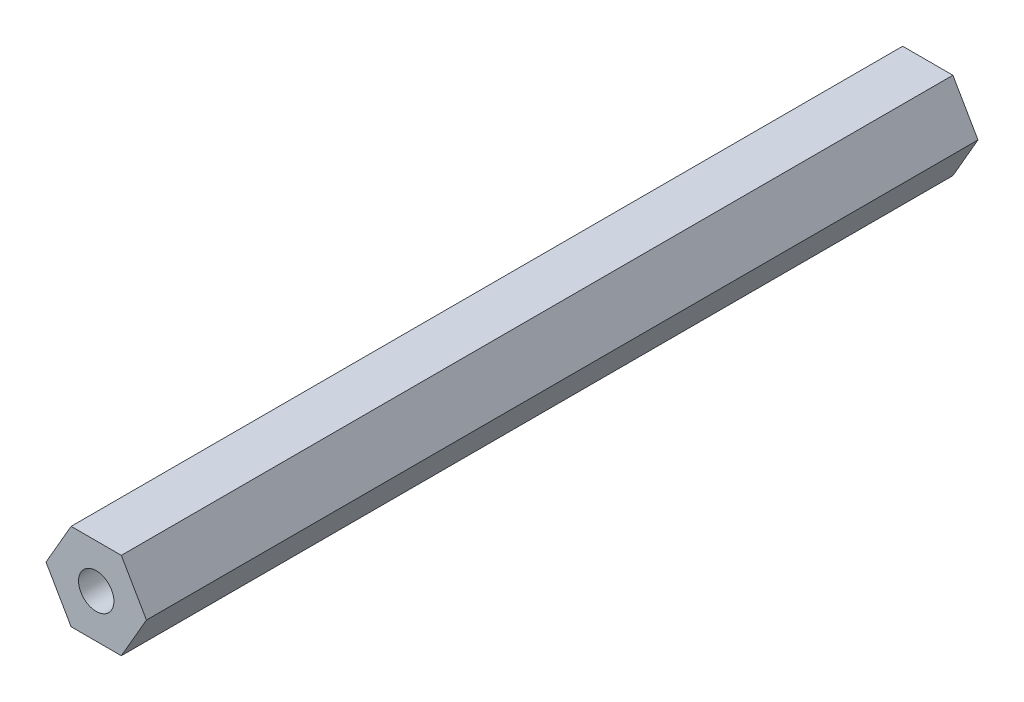
ISO-10303-21;
HEADER;
FILE_DESCRIPTION(('STEP AP214'),'2;1');
FILE_NAME('part.step','',(''),(''),'','','');
FILE_SCHEMA(('AUTOMOTIVE_DESIGN { 1 0 10303 214 1 1 1 1 }'));
ENDSEC;
DATA;
#1=APPLICATION_CONTEXT('core data for automotive mechanical design processes');
#2=APPLICATION_PROTOCOL_DEFINITION('international standard','automotive_design',2000,#1);
#3=PRODUCT_CONTEXT('',#1,'mechanical');
#4=PRODUCT('Part','Part','',(#3));
#5=PRODUCT_RELATED_PRODUCT_CATEGORY('part','',(#4));
#6=PRODUCT_DEFINITION_FORMATION('','',#4);
#7=PRODUCT_DEFINITION_CONTEXT('part definition',#1,'design');
#8=PRODUCT_DEFINITION('design','',#6,#7);
#9=PRODUCT_DEFINITION_SHAPE('','',#8);
#10=(LENGTH_UNIT() NAMED_UNIT(*) SI_UNIT(.MILLI.,.METRE.));
#11=(NAMED_UNIT(*) PLANE_ANGLE_UNIT() SI_UNIT($,.RADIAN.));
#12=(NAMED_UNIT(*) SI_UNIT($,.STERADIAN.) SOLID_ANGLE_UNIT());
#13=UNCERTAINTY_MEASURE_WITH_UNIT(LENGTH_MEASURE(1.E-05),#10,'distance_accuracy_value','');
#14=(GEOMETRIC_REPRESENTATION_CONTEXT(3) GLOBAL_UNCERTAINTY_ASSIGNED_CONTEXT((#13)) GLOBAL_UNIT_ASSIGNED_CONTEXT((#10,
#11,#12)) REPRESENTATION_CONTEXT('',''));
#15=CARTESIAN_POINT('',(0.,0.,0.));
#16=DIRECTION('',(0.,0.,1.));
#17=DIRECTION('',(1.,0.,0.));
#18=AXIS2_PLACEMENT_3D('',#15,#16,#17);
#19=CARTESIAN_POINT('',(3.66617420935413,-6.35000000000001,121.412));
#20=DIRECTION('',(-0.866025403784439,0.5,0.));
#21=DIRECTION('',(-0.5,-0.866025403784439,0.));
#22=AXIS2_PLACEMENT_3D('',#19,#20,#21);
#23=PLANE('',#22);
#24=DIRECTION('',(0.5,0.866025403784439,0.));
#25=VECTOR('',#24,1.);
#26=CARTESIAN_POINT('',(3.66617420935413,-6.35000000000001,0.));
#27=LINE('',#26,#25);
#28=CARTESIAN_POINT('',(3.66617420935413,-6.35000000000001,0.));
#29=VERTEX_POINT('',#28);
#30=CARTESIAN_POINT('',(7.33234841870825,0.,0.));
#31=VERTEX_POINT('',#30);
#32=EDGE_CURVE('E118',#29,#31,#27,.T.);
#33=ORIENTED_EDGE('',*,*,#32,.T.);
#34=DIRECTION('',(0.,0.,-1.));
#35=VECTOR('',#34,1.);
#36=CARTESIAN_POINT('',(7.33234841870825,0.,121.412));
#37=LINE('',#36,#35);
#38=CARTESIAN_POINT('',(7.33234841870825,0.,121.412));
#39=VERTEX_POINT('',#38);
#40=EDGE_CURVE('E11',#39,#31,#37,.T.);
#41=ORIENTED_EDGE('',*,*,#40,.F.);
#42=DIRECTION('',(0.5,0.866025403784439,0.));
#43=VECTOR('',#42,1.);
#44=CARTESIAN_POINT('',(3.66617420935413,-6.35000000000001,121.412));
#45=LINE('',#44,#43);
#46=CARTESIAN_POINT('',(3.66617420935413,-6.35000000000001,121.412));
#47=VERTEX_POINT('',#46);
#48=EDGE_CURVE('E129',#47,#39,#45,.T.);
#49=ORIENTED_EDGE('',*,*,#48,.F.);
#50=DIRECTION('',(0.,0.,-1.));
#51=VECTOR('',#50,1.);
#52=CARTESIAN_POINT('',(3.66617420935413,-6.35000000000001,121.412));
#53=LINE('',#52,#51);
#54=EDGE_CURVE('E114',#47,#29,#53,.T.);
#55=ORIENTED_EDGE('',*,*,#54,.T.);
#56=EDGE_LOOP('',(#33,#41,#49,#55));
#57=FACE_BOUND('',#56,.T.);
#58=ADVANCED_FACE('F34',(#57),#23,.F.);
#59=CARTESIAN_POINT('',(7.33234841870825,0.,121.412));
#60=DIRECTION('',(-0.866025403784439,-0.5,0.));
#61=DIRECTION('',(0.5,-0.866025403784439,0.));
#62=AXIS2_PLACEMENT_3D('',#59,#60,#61);
#63=PLANE('',#62);
#64=DIRECTION('',(-0.5,0.866025403784439,0.));
#65=VECTOR('',#64,1.);
#66=CARTESIAN_POINT('',(7.33234841870825,0.,0.));
#67=LINE('',#66,#65);
#68=CARTESIAN_POINT('',(3.66617420935412,6.35000000000002,0.));
#69=VERTEX_POINT('',#68);
#70=EDGE_CURVE('E121',#31,#69,#67,.T.);
#71=ORIENTED_EDGE('',*,*,#70,.T.);
#72=DIRECTION('',(0.,0.,-1.));
#73=VECTOR('',#72,1.);
#74=CARTESIAN_POINT('',(3.66617420935412,6.35000000000002,121.412));
#75=LINE('',#74,#73);
#76=CARTESIAN_POINT('',(3.66617420935412,6.35000000000002,121.412));
#77=VERTEX_POINT('',#76);
#78=EDGE_CURVE('E42',#77,#69,#75,.T.);
#79=ORIENTED_EDGE('',*,*,#78,.F.);
#80=DIRECTION('',(-0.5,0.866025403784439,0.));
#81=VECTOR('',#80,1.);
#82=CARTESIAN_POINT('',(7.33234841870825,0.,121.412));
#83=LINE('',#82,#81);
#84=EDGE_CURVE('E87',#39,#77,#83,.T.);
#85=ORIENTED_EDGE('',*,*,#84,.F.);
#86=ORIENTED_EDGE('',*,*,#40,.T.);
#87=EDGE_LOOP('',(#71,#79,#85,#86));
#88=FACE_BOUND('',#87,.T.);
#89=ADVANCED_FACE('F154',(#88),#63,.F.);
#90=CARTESIAN_POINT('',(3.66617420935412,6.35000000000002,121.412));
#91=DIRECTION('',(0.,-1.,0.));
#92=DIRECTION('',(0.,0.,-1.));
#93=AXIS2_PLACEMENT_3D('',#90,#91,#92);
#94=PLANE('',#93);
#95=DIRECTION('',(-1.,0.,0.));
#96=VECTOR('',#95,1.);
#97=CARTESIAN_POINT('',(3.66617420935412,6.35000000000002,0.));
#98=LINE('',#97,#96);
#99=CARTESIAN_POINT('',(-3.66617420935413,6.35000000000002,0.));
#100=VERTEX_POINT('',#99);
#101=EDGE_CURVE('E124',#69,#100,#98,.T.);
#102=ORIENTED_EDGE('',*,*,#101,.T.);
#103=DIRECTION('',(0.,0.,-1.));
#104=VECTOR('',#103,1.);
#105=CARTESIAN_POINT('',(-3.66617420935413,6.35000000000002,121.412));
#106=LINE('',#105,#104);
#107=CARTESIAN_POINT('',(-3.66617420935413,6.35000000000002,121.412));
#108=VERTEX_POINT('',#107);
#109=EDGE_CURVE('E109',#108,#100,#106,.T.);
#110=ORIENTED_EDGE('',*,*,#109,.F.);
#111=DIRECTION('',(-1.,0.,0.));
#112=VECTOR('',#111,1.);
#113=CARTESIAN_POINT('',(3.66617420935412,6.35000000000002,121.412));
#114=LINE('',#113,#112);
#115=EDGE_CURVE('E100',#77,#108,#114,.T.);
#116=ORIENTED_EDGE('',*,*,#115,.F.);
#117=ORIENTED_EDGE('',*,*,#78,.T.);
#118=EDGE_LOOP('',(#102,#110,#116,#117));
#119=FACE_BOUND('',#118,.T.);
#120=ADVANCED_FACE('F135',(#119),#94,.F.);
#121=CARTESIAN_POINT('',(-3.66617420935413,6.35000000000002,121.412));
#122=DIRECTION('',(0.866025403784439,-0.499999999999999,0.));
#123=DIRECTION('',(0.499999999999999,0.866025403784439,0.));
#124=AXIS2_PLACEMENT_3D('',#121,#122,#123);
#125=PLANE('',#124);
#126=DIRECTION('',(-0.499999999999999,-0.866025403784439,0.));
#127=VECTOR('',#126,1.);
#128=CARTESIAN_POINT('',(-3.66617420935413,6.35000000000002,0.));
#129=LINE('',#128,#127);
#130=CARTESIAN_POINT('',(-7.33234841870826,0.,0.));
#131=VERTEX_POINT('',#130);
#132=EDGE_CURVE('E108',#100,#131,#129,.T.);
#133=ORIENTED_EDGE('',*,*,#132,.T.);
#134=DIRECTION('',(0.,0.,-1.));
#135=VECTOR('',#134,1.);
#136=CARTESIAN_POINT('',(-7.33234841870826,0.,121.412));
#137=LINE('',#136,#135);
#138=CARTESIAN_POINT('',(-7.33234841870826,0.,121.412));
#139=VERTEX_POINT('',#138);
#140=EDGE_CURVE('E105',#139,#131,#137,.T.);
#141=ORIENTED_EDGE('',*,*,#140,.F.);
#142=DIRECTION('',(-0.499999999999999,-0.866025403784439,0.));
#143=VECTOR('',#142,1.);
#144=CARTESIAN_POINT('',(-3.66617420935413,6.35000000000002,121.412));
#145=LINE('',#144,#143);
#146=EDGE_CURVE('E94',#108,#139,#145,.T.);
#147=ORIENTED_EDGE('',*,*,#146,.F.);
#148=ORIENTED_EDGE('',*,*,#109,.T.);
#149=EDGE_LOOP('',(#133,#141,#147,#148));
#150=FACE_BOUND('',#149,.T.);
#151=ADVANCED_FACE('F106',(#150),#125,.F.);
#152=CARTESIAN_POINT('',(-7.33234841870826,0.,121.412));
#153=DIRECTION('',(0.866025403784439,0.5,0.));
#154=DIRECTION('',(-0.5,0.866025403784439,0.));
#155=AXIS2_PLACEMENT_3D('',#152,#153,#154);
#156=PLANE('',#155);
#157=DIRECTION('',(0.5,-0.866025403784439,0.));
#158=VECTOR('',#157,1.);
#159=CARTESIAN_POINT('',(-7.33234841870826,0.,0.));
#160=LINE('',#159,#158);
#161=CARTESIAN_POINT('',(-3.66617420935413,-6.35000000000001,0.));
#162=VERTEX_POINT('',#161);
#163=EDGE_CURVE('E73',#131,#162,#160,.T.);
#164=ORIENTED_EDGE('',*,*,#163,.T.);
#165=DIRECTION('',(0.,0.,-1.));
#166=VECTOR('',#165,1.);
#167=CARTESIAN_POINT('',(-3.66617420935413,-6.35000000000001,121.412));
#168=LINE('',#167,#166);
#169=CARTESIAN_POINT('',(-3.66617420935413,-6.35000000000001,121.412));
#170=VERTEX_POINT('',#169);
#171=EDGE_CURVE('E110',#170,#162,#168,.T.);
#172=ORIENTED_EDGE('',*,*,#171,.F.);
#173=DIRECTION('',(0.5,-0.866025403784439,0.));
#174=VECTOR('',#173,1.);
#175=CARTESIAN_POINT('',(-7.33234841870826,0.,121.412));
#176=LINE('',#175,#174);
#177=EDGE_CURVE('E98',#139,#170,#176,.T.);
#178=ORIENTED_EDGE('',*,*,#177,.F.);
#179=ORIENTED_EDGE('',*,*,#140,.T.);
#180=EDGE_LOOP('',(#164,#172,#178,#179));
#181=FACE_BOUND('',#180,.T.);
#182=ADVANCED_FACE('F112',(#181),#156,.F.);
#183=CARTESIAN_POINT('',(-3.66617420935413,-6.35000000000001,121.412));
#184=DIRECTION('',(0.,1.,0.));
#185=DIRECTION('',(0.,0.,1.));
#186=AXIS2_PLACEMENT_3D('',#183,#184,#185);
#187=PLANE('',#186);
#188=DIRECTION('',(1.,0.,0.));
#189=VECTOR('',#188,1.);
#190=CARTESIAN_POINT('',(-3.66617420935413,-6.35000000000001,0.));
#191=LINE('',#190,#189);
#192=EDGE_CURVE('E79',#162,#29,#191,.T.);
#193=ORIENTED_EDGE('',*,*,#192,.T.);
#194=ORIENTED_EDGE('',*,*,#54,.F.);
#195=DIRECTION('',(1.,0.,0.));
#196=VECTOR('',#195,1.);
#197=CARTESIAN_POINT('',(-3.66617420935413,-6.35000000000001,121.412));
#198=LINE('',#197,#196);
#199=EDGE_CURVE('E50',#170,#47,#198,.T.);
#200=ORIENTED_EDGE('',*,*,#199,.F.);
#201=ORIENTED_EDGE('',*,*,#171,.T.);
#202=EDGE_LOOP('',(#193,#194,#200,#201));
#203=FACE_BOUND('',#202,.T.);
#204=ADVANCED_FACE('F142',(#203),#187,.F.);
#205=CARTESIAN_POINT('',(0.,0.,121.412));
#206=DIRECTION('',(0.,0.,1.));
#207=DIRECTION('',(1.,0.,0.));
#208=AXIS2_PLACEMENT_3D('',#205,#206,#207);
#209=PLANE('',#208);
#210=CARTESIAN_POINT('',(0.,0.,121.412));
#211=DIRECTION('',(0.,0.,1.));
#212=DIRECTION('',(1.,0.,0.));
#213=AXIS2_PLACEMENT_3D('',#210,#211,#212);
#214=CIRCLE('',#213,2.5796875);
#215=CARTESIAN_POINT('',(2.5796875,0.,121.412));
#216=VERTEX_POINT('',#215);
#217=EDGE_CURVE('E237',#216,#216,#214,.T.);
#218=ORIENTED_EDGE('',*,*,#217,.F.);
#219=EDGE_LOOP('',(#218));
#220=FACE_BOUND('',#219,.T.);
#221=ORIENTED_EDGE('',*,*,#48,.T.);
#222=ORIENTED_EDGE('',*,*,#84,.T.);
#223=ORIENTED_EDGE('',*,*,#115,.T.);
#224=ORIENTED_EDGE('',*,*,#146,.T.);
#225=ORIENTED_EDGE('',*,*,#177,.T.);
#226=ORIENTED_EDGE('',*,*,#199,.T.);
#227=EDGE_LOOP('',(#221,#222,#223,#224,#225,#226));
#228=FACE_BOUND('',#227,.T.);
#229=ADVANCED_FACE('F96',(#220,#228),#209,.T.);
#230=CARTESIAN_POINT('',(0.,0.,0.));
#231=DIRECTION('',(0.,0.,1.));
#232=DIRECTION('',(1.,0.,0.));
#233=AXIS2_PLACEMENT_3D('',#230,#231,#232);
#234=PLANE('',#233);
#235=CARTESIAN_POINT('',(0.,0.,0.));
#236=DIRECTION('',(0.,0.,1.));
#237=DIRECTION('',(1.,0.,0.));
#238=AXIS2_PLACEMENT_3D('',#235,#236,#237);
#239=CIRCLE('',#238,2.5796875);
#240=CARTESIAN_POINT('',(2.5796875,0.,0.));
#241=VERTEX_POINT('',#240);
#242=EDGE_CURVE('E238',#241,#241,#239,.T.);
#243=ORIENTED_EDGE('',*,*,#242,.T.);
#244=EDGE_LOOP('',(#243));
#245=FACE_BOUND('',#244,.T.);
#246=ORIENTED_EDGE('',*,*,#32,.F.);
#247=ORIENTED_EDGE('',*,*,#192,.F.);
#248=ORIENTED_EDGE('',*,*,#163,.F.);
#249=ORIENTED_EDGE('',*,*,#132,.F.);
#250=ORIENTED_EDGE('',*,*,#101,.F.);
#251=ORIENTED_EDGE('',*,*,#70,.F.);
#252=EDGE_LOOP('',(#246,#247,#248,#249,#250,#251));
#253=FACE_BOUND('',#252,.T.);
#254=ADVANCED_FACE('F138',(#245,#253),#234,.F.);
#255=CARTESIAN_POINT('',(0.,0.,108.712));
#256=DIRECTION('',(0.,0.,1.));
#257=DIRECTION('',(1.,0.,0.));
#258=AXIS2_PLACEMENT_3D('',#255,#256,#257);
#259=CYLINDRICAL_SURFACE('',#258,2.5796875);
#260=CARTESIAN_POINT('',(0.,0.,108.712));
#261=DIRECTION('',(0.,0.,1.));
#262=DIRECTION('',(1.,0.,0.));
#263=AXIS2_PLACEMENT_3D('',#260,#261,#262);
#264=CIRCLE('',#263,2.5796875);
#265=CARTESIAN_POINT('',(2.5796875,0.,108.712));
#266=VERTEX_POINT('',#265);
#267=EDGE_CURVE('E122',#266,#266,#264,.T.);
#268=ORIENTED_EDGE('',*,*,#267,.F.);
#269=EDGE_LOOP('',(#268));
#270=FACE_BOUND('',#269,.T.);
#271=ORIENTED_EDGE('',*,*,#217,.T.);
#272=EDGE_LOOP('',(#271));
#273=FACE_BOUND('',#272,.T.);
#274=ADVANCED_FACE('F189',(#270,#273),#259,.F.);
#275=CARTESIAN_POINT('',(0.,0.,108.712));
#276=DIRECTION('',(0.,0.,1.));
#277=DIRECTION('',(1.,0.,0.));
#278=AXIS2_PLACEMENT_3D('',#275,#276,#277);
#279=PLANE('',#278);
#280=ORIENTED_EDGE('',*,*,#267,.T.);
#281=EDGE_LOOP('',(#280));
#282=FACE_BOUND('',#281,.T.);
#283=ADVANCED_FACE('F194',(#282),#279,.T.);
#284=CARTESIAN_POINT('',(0.,0.,12.7));
#285=DIRECTION('',(0.,0.,-1.));
#286=DIRECTION('',(-1.,0.,0.));
#287=AXIS2_PLACEMENT_3D('',#284,#285,#286);
#288=CYLINDRICAL_SURFACE('',#287,2.5796875);
#289=CARTESIAN_POINT('',(0.,0.,12.7));
#290=DIRECTION('',(0.,0.,1.));
#291=DIRECTION('',(1.,0.,0.));
#292=AXIS2_PLACEMENT_3D('',#289,#290,#291);
#293=CIRCLE('',#292,2.5796875);
#294=CARTESIAN_POINT('',(2.5796875,0.,12.7));
#295=VERTEX_POINT('',#294);
#296=EDGE_CURVE('E236',#295,#295,#293,.T.);
#297=ORIENTED_EDGE('',*,*,#296,.T.);
#298=EDGE_LOOP('',(#297));
#299=FACE_BOUND('',#298,.T.);
#300=ORIENTED_EDGE('',*,*,#242,.F.);
#301=EDGE_LOOP('',(#300));
#302=FACE_BOUND('',#301,.T.);
#303=ADVANCED_FACE('F204',(#299,#302),#288,.F.);
#304=CARTESIAN_POINT('',(0.,0.,12.7));
#305=DIRECTION('',(0.,0.,-1.));
#306=DIRECTION('',(1.,0.,0.));
#307=AXIS2_PLACEMENT_3D('',#304,#305,#306);
#308=PLANE('',#307);
#309=ORIENTED_EDGE('',*,*,#296,.F.);
#310=EDGE_LOOP('',(#309));
#311=FACE_BOUND('',#310,.T.);
#312=ADVANCED_FACE('F220',(#311),#308,.T.);
#313=CLOSED_SHELL('',(#58,#89,#120,#151,#182,#204,#229,#254,#274,#283,#303,#312));
#314=MANIFOLD_SOLID_BREP('B2',#313);
#315=ADVANCED_BREP_SHAPE_REPRESENTATION('',(#18,#314),#14);
#316=SHAPE_DEFINITION_REPRESENTATION(#9,#315);
ENDSEC;
END-ISO-10303-21;
